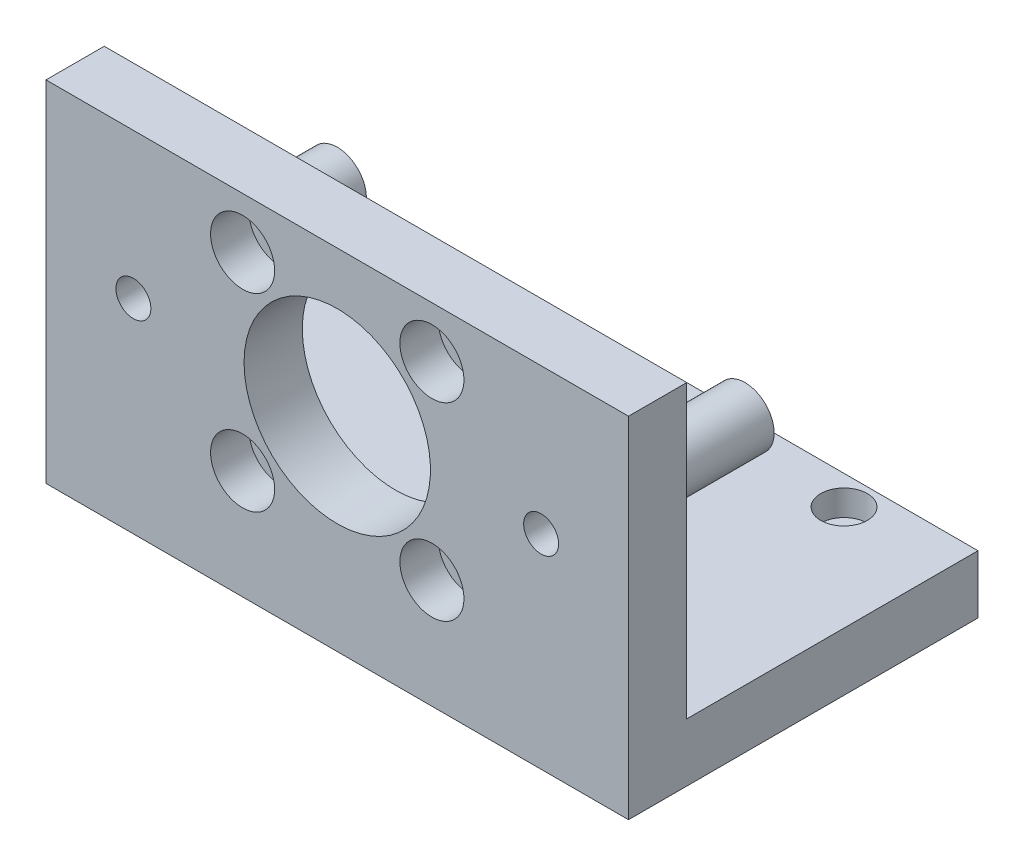
ISO-10303-21;
HEADER;
FILE_DESCRIPTION(('STEP AP214'),'2;1');
FILE_NAME('part.step','',(''),(''),'','','');
FILE_SCHEMA(('AUTOMOTIVE_DESIGN { 1 0 10303 214 1 1 1 1 }'));
ENDSEC;
DATA;
#1=APPLICATION_CONTEXT('core data for automotive mechanical design processes');
#2=APPLICATION_PROTOCOL_DEFINITION('international standard','automotive_design',2000,#1);
#3=PRODUCT_CONTEXT('',#1,'mechanical');
#4=PRODUCT('Part','Part','',(#3));
#5=PRODUCT_RELATED_PRODUCT_CATEGORY('part','',(#4));
#6=PRODUCT_DEFINITION_FORMATION('','',#4);
#7=PRODUCT_DEFINITION_CONTEXT('part definition',#1,'design');
#8=PRODUCT_DEFINITION('design','',#6,#7);
#9=PRODUCT_DEFINITION_SHAPE('','',#8);
#10=(LENGTH_UNIT() NAMED_UNIT(*) SI_UNIT(.MILLI.,.METRE.));
#11=(NAMED_UNIT(*) PLANE_ANGLE_UNIT() SI_UNIT($,.RADIAN.));
#12=(NAMED_UNIT(*) SI_UNIT($,.STERADIAN.) SOLID_ANGLE_UNIT());
#13=UNCERTAINTY_MEASURE_WITH_UNIT(LENGTH_MEASURE(1.E-05),#10,'distance_accuracy_value','');
#14=(GEOMETRIC_REPRESENTATION_CONTEXT(3) GLOBAL_UNCERTAINTY_ASSIGNED_CONTEXT((#13)) GLOBAL_UNIT_ASSIGNED_CONTEXT((#10,
#11,#12)) REPRESENTATION_CONTEXT('',''));
#15=CARTESIAN_POINT('',(0.,0.,0.));
#16=DIRECTION('',(0.,0.,1.));
#17=DIRECTION('',(1.,0.,0.));
#18=AXIS2_PLACEMENT_3D('',#15,#16,#17);
#19=CARTESIAN_POINT('',(0.,0.,25.));
#20=DIRECTION('',(0.,0.,-1.));
#21=DIRECTION('',(-1.,0.,0.));
#22=AXIS2_PLACEMENT_3D('',#19,#20,#21);
#23=PLANE('',#22);
#24=CARTESIAN_POINT('',(35.,35.,25.));
#25=DIRECTION('',(0.,0.,-1.));
#26=DIRECTION('',(-1.,0.,0.));
#27=AXIS2_PLACEMENT_3D('',#24,#25,#26);
#28=CIRCLE('',#27,5.);
#29=CARTESIAN_POINT('',(30.,35.,25.));
#30=VERTEX_POINT('',#29);
#31=EDGE_CURVE('E525',#30,#30,#28,.T.);
#32=ORIENTED_EDGE('',*,*,#31,.F.);
#33=EDGE_LOOP('',(#32));
#34=FACE_BOUND('',#33,.T.);
#35=CARTESIAN_POINT('',(-16.25,51.25,25.));
#36=DIRECTION('',(0.,0.,-1.));
#37=DIRECTION('',(-1.,0.,0.));
#38=AXIS2_PLACEMENT_3D('',#35,#36,#37);
#39=CIRCLE('',#38,3.3);
#40=CARTESIAN_POINT('',(-19.55,51.25,25.));
#41=VERTEX_POINT('',#40);
#42=EDGE_CURVE('E171',#41,#41,#39,.T.);
#43=ORIENTED_EDGE('',*,*,#42,.F.);
#44=EDGE_LOOP('',(#43));
#45=FACE_BOUND('',#44,.T.);
#46=CARTESIAN_POINT('',(-16.25,18.75,25.));
#47=DIRECTION('',(0.,0.,-1.));
#48=DIRECTION('',(-1.,0.,0.));
#49=AXIS2_PLACEMENT_3D('',#46,#47,#48);
#50=CIRCLE('',#49,3.3);
#51=CARTESIAN_POINT('',(-19.55,18.75,25.));
#52=VERTEX_POINT('',#51);
#53=EDGE_CURVE('E177',#52,#52,#50,.T.);
#54=ORIENTED_EDGE('',*,*,#53,.F.);
#55=EDGE_LOOP('',(#54));
#56=FACE_BOUND('',#55,.T.);
#57=CARTESIAN_POINT('',(16.25,18.75,25.));
#58=DIRECTION('',(0.,0.,-1.));
#59=DIRECTION('',(-1.,0.,0.));
#60=AXIS2_PLACEMENT_3D('',#57,#58,#59);
#61=CIRCLE('',#60,3.3);
#62=CARTESIAN_POINT('',(12.95,18.75,25.));
#63=VERTEX_POINT('',#62);
#64=EDGE_CURVE('E184',#63,#63,#61,.T.);
#65=ORIENTED_EDGE('',*,*,#64,.F.);
#66=EDGE_LOOP('',(#65));
#67=FACE_BOUND('',#66,.T.);
#68=CARTESIAN_POINT('',(16.25,51.25,25.));
#69=DIRECTION('',(0.,0.,-1.));
#70=DIRECTION('',(-1.,0.,0.));
#71=AXIS2_PLACEMENT_3D('',#68,#69,#70);
#72=CIRCLE('',#71,3.3);
#73=CARTESIAN_POINT('',(12.95,51.25,25.));
#74=VERTEX_POINT('',#73);
#75=EDGE_CURVE('E188',#74,#74,#72,.T.);
#76=ORIENTED_EDGE('',*,*,#75,.F.);
#77=EDGE_LOOP('',(#76));
#78=FACE_BOUND('',#77,.T.);
#79=CARTESIAN_POINT('',(0.,35.,25.));
#80=DIRECTION('',(0.,0.,-1.));
#81=DIRECTION('',(-1.,0.,0.));
#82=AXIS2_PLACEMENT_3D('',#79,#80,#81);
#83=CIRCLE('',#82,16.);
#84=CARTESIAN_POINT('',(-16.,35.,25.));
#85=VERTEX_POINT('',#84);
#86=EDGE_CURVE('E192',#85,#85,#83,.T.);
#87=ORIENTED_EDGE('',*,*,#86,.F.);
#88=EDGE_LOOP('',(#87));
#89=FACE_BOUND('',#88,.T.);
#90=DIRECTION('',(1.,0.,0.));
#91=VECTOR('',#90,1.);
#92=CARTESIAN_POINT('',(-50.,10.,25.));
#93=LINE('',#92,#91);
#94=CARTESIAN_POINT('',(-50.,10.,25.));
#95=VERTEX_POINT('',#94);
#96=CARTESIAN_POINT('',(50.,10.,25.));
#97=VERTEX_POINT('',#96);
#98=EDGE_CURVE('E81',#95,#97,#93,.T.);
#99=ORIENTED_EDGE('',*,*,#98,.F.);
#100=DIRECTION('',(0.,-1.,0.));
#101=VECTOR('',#100,1.);
#102=CARTESIAN_POINT('',(-50.,0.,25.));
#103=LINE('',#102,#101);
#104=CARTESIAN_POINT('',(-50.,60.,25.));
#105=VERTEX_POINT('',#104);
#106=EDGE_CURVE('E197',#105,#95,#103,.T.);
#107=ORIENTED_EDGE('',*,*,#106,.F.);
#108=DIRECTION('',(-1.,0.,0.));
#109=VECTOR('',#108,1.);
#110=CARTESIAN_POINT('',(-50.,60.,25.));
#111=LINE('',#110,#109);
#112=CARTESIAN_POINT('',(50.,60.,25.));
#113=VERTEX_POINT('',#112);
#114=EDGE_CURVE('E206',#113,#105,#111,.T.);
#115=ORIENTED_EDGE('',*,*,#114,.F.);
#116=DIRECTION('',(0.,1.,0.));
#117=VECTOR('',#116,1.);
#118=CARTESIAN_POINT('',(50.,0.,25.));
#119=LINE('',#118,#117);
#120=EDGE_CURVE('E64',#97,#113,#119,.T.);
#121=ORIENTED_EDGE('',*,*,#120,.F.);
#122=EDGE_LOOP('',(#99,#107,#115,#121));
#123=FACE_BOUND('',#122,.T.);
#124=CARTESIAN_POINT('',(-35.,35.,25.));
#125=DIRECTION('',(0.,0.,-1.));
#126=DIRECTION('',(-1.,0.,0.));
#127=AXIS2_PLACEMENT_3D('',#124,#125,#126);
#128=CIRCLE('',#127,5.);
#129=CARTESIAN_POINT('',(-40.,35.,25.));
#130=VERTEX_POINT('',#129);
#131=EDGE_CURVE('E512',#130,#130,#128,.T.);
#132=ORIENTED_EDGE('',*,*,#131,.F.);
#133=EDGE_LOOP('',(#132));
#134=FACE_BOUND('',#133,.T.);
#135=ADVANCED_FACE('F44',(#34,#45,#56,#67,#78,#89,#123,#134),#23,.T.);
#136=CARTESIAN_POINT('',(16.25,51.25,35.));
#137=DIRECTION('',(0.,0.,-1.));
#138=DIRECTION('',(-1.,0.,0.));
#139=AXIS2_PLACEMENT_3D('',#136,#137,#138);
#140=CYLINDRICAL_SURFACE('',#139,3.3);
#141=ORIENTED_EDGE('',*,*,#75,.T.);
#142=EDGE_LOOP('',(#141));
#143=FACE_BOUND('',#142,.T.);
#144=CARTESIAN_POINT('',(16.25,51.25,28.4));
#145=DIRECTION('',(0.,0.,1.));
#146=DIRECTION('',(1.,0.,0.));
#147=AXIS2_PLACEMENT_3D('',#144,#145,#146);
#148=CIRCLE('',#147,3.3);
#149=CARTESIAN_POINT('',(19.55,51.25,28.4));
#150=VERTEX_POINT('',#149);
#151=EDGE_CURVE('E48',#150,#150,#148,.F.);
#152=ORIENTED_EDGE('',*,*,#151,.F.);
#153=EDGE_LOOP('',(#152));
#154=FACE_BOUND('',#153,.T.);
#155=ADVANCED_FACE('F307',(#143,#154),#140,.F.);
#156=CARTESIAN_POINT('',(16.25,18.75,35.));
#157=DIRECTION('',(0.,0.,-1.));
#158=DIRECTION('',(-1.,0.,0.));
#159=AXIS2_PLACEMENT_3D('',#156,#157,#158);
#160=CYLINDRICAL_SURFACE('',#159,3.3);
#161=ORIENTED_EDGE('',*,*,#64,.T.);
#162=EDGE_LOOP('',(#161));
#163=FACE_BOUND('',#162,.T.);
#164=CARTESIAN_POINT('',(16.25,18.75,28.4));
#165=DIRECTION('',(0.,0.,1.));
#166=DIRECTION('',(1.,0.,0.));
#167=AXIS2_PLACEMENT_3D('',#164,#165,#166);
#168=CIRCLE('',#167,3.3);
#169=CARTESIAN_POINT('',(19.55,18.75,28.4));
#170=VERTEX_POINT('',#169);
#171=EDGE_CURVE('E163',#170,#170,#168,.F.);
#172=ORIENTED_EDGE('',*,*,#171,.F.);
#173=EDGE_LOOP('',(#172));
#174=FACE_BOUND('',#173,.T.);
#175=ADVANCED_FACE('F313',(#163,#174),#160,.F.);
#176=CARTESIAN_POINT('',(-16.25,18.75,35.));
#177=DIRECTION('',(0.,0.,-1.));
#178=DIRECTION('',(-1.,0.,0.));
#179=AXIS2_PLACEMENT_3D('',#176,#177,#178);
#180=CYLINDRICAL_SURFACE('',#179,3.3);
#181=ORIENTED_EDGE('',*,*,#53,.T.);
#182=EDGE_LOOP('',(#181));
#183=FACE_BOUND('',#182,.T.);
#184=CARTESIAN_POINT('',(-16.25,18.75,28.4));
#185=DIRECTION('',(0.,0.,1.));
#186=DIRECTION('',(1.,0.,0.));
#187=AXIS2_PLACEMENT_3D('',#184,#185,#186);
#188=CIRCLE('',#187,3.3);
#189=CARTESIAN_POINT('',(-12.95,18.75,28.4));
#190=VERTEX_POINT('',#189);
#191=EDGE_CURVE('E159',#190,#190,#188,.F.);
#192=ORIENTED_EDGE('',*,*,#191,.F.);
#193=EDGE_LOOP('',(#192));
#194=FACE_BOUND('',#193,.T.);
#195=ADVANCED_FACE('F369',(#183,#194),#180,.F.);
#196=CARTESIAN_POINT('',(-16.25,51.25,35.));
#197=DIRECTION('',(0.,0.,-1.));
#198=DIRECTION('',(-1.,0.,0.));
#199=AXIS2_PLACEMENT_3D('',#196,#197,#198);
#200=CYLINDRICAL_SURFACE('',#199,3.3);
#201=ORIENTED_EDGE('',*,*,#42,.T.);
#202=EDGE_LOOP('',(#201));
#203=FACE_BOUND('',#202,.T.);
#204=CARTESIAN_POINT('',(-16.25,51.25,28.4));
#205=DIRECTION('',(0.,0.,1.));
#206=DIRECTION('',(1.,0.,0.));
#207=AXIS2_PLACEMENT_3D('',#204,#205,#206);
#208=CIRCLE('',#207,3.3);
#209=CARTESIAN_POINT('',(-12.95,51.25,28.4));
#210=VERTEX_POINT('',#209);
#211=EDGE_CURVE('E155',#210,#210,#208,.F.);
#212=ORIENTED_EDGE('',*,*,#211,.F.);
#213=EDGE_LOOP('',(#212));
#214=FACE_BOUND('',#213,.T.);
#215=ADVANCED_FACE('F364',(#203,#214),#200,.F.);
#216=CARTESIAN_POINT('',(32.,0.,-20.));
#217=DIRECTION('',(0.,1.,0.));
#218=DIRECTION('',(0.,0.,1.));
#219=AXIS2_PLACEMENT_3D('',#216,#217,#218);
#220=CYLINDRICAL_SURFACE('',#219,2.25);
#221=CARTESIAN_POINT('',(32.,0.,-20.));
#222=DIRECTION('',(0.,1.,0.));
#223=DIRECTION('',(0.,0.,1.));
#224=AXIS2_PLACEMENT_3D('',#221,#222,#223);
#225=CIRCLE('',#224,2.25);
#226=CARTESIAN_POINT('',(32.,0.,-17.75));
#227=VERTEX_POINT('',#226);
#228=EDGE_CURVE('E120',#227,#227,#225,.T.);
#229=ORIENTED_EDGE('',*,*,#228,.F.);
#230=EDGE_LOOP('',(#229));
#231=FACE_BOUND('',#230,.T.);
#232=CARTESIAN_POINT('',(32.,5.6,-20.));
#233=DIRECTION('',(0.,1.,0.));
#234=DIRECTION('',(0.,0.,1.));
#235=AXIS2_PLACEMENT_3D('',#232,#233,#234);
#236=CIRCLE('',#235,2.25);
#237=CARTESIAN_POINT('',(32.,5.6,-17.75));
#238=VERTEX_POINT('',#237);
#239=EDGE_CURVE('E150',#238,#238,#236,.F.);
#240=ORIENTED_EDGE('',*,*,#239,.F.);
#241=EDGE_LOOP('',(#240));
#242=FACE_BOUND('',#241,.T.);
#243=ADVANCED_FACE('F354',(#231,#242),#220,.F.);
#244=CARTESIAN_POINT('',(32.,0.,20.));
#245=DIRECTION('',(0.,1.,0.));
#246=DIRECTION('',(0.,0.,1.));
#247=AXIS2_PLACEMENT_3D('',#244,#245,#246);
#248=CYLINDRICAL_SURFACE('',#247,2.25);
#249=CARTESIAN_POINT('',(32.,0.,20.));
#250=DIRECTION('',(0.,1.,0.));
#251=DIRECTION('',(0.,0.,1.));
#252=AXIS2_PLACEMENT_3D('',#249,#250,#251);
#253=CIRCLE('',#252,2.25);
#254=CARTESIAN_POINT('',(32.,0.,22.25));
#255=VERTEX_POINT('',#254);
#256=EDGE_CURVE('E127',#255,#255,#253,.T.);
#257=ORIENTED_EDGE('',*,*,#256,.F.);
#258=EDGE_LOOP('',(#257));
#259=FACE_BOUND('',#258,.T.);
#260=CARTESIAN_POINT('',(32.,5.6,20.));
#261=DIRECTION('',(0.,1.,0.));
#262=DIRECTION('',(0.,0.,1.));
#263=AXIS2_PLACEMENT_3D('',#260,#261,#262);
#264=CIRCLE('',#263,2.25);
#265=CARTESIAN_POINT('',(32.,5.6,22.25));
#266=VERTEX_POINT('',#265);
#267=EDGE_CURVE('E146',#266,#266,#264,.F.);
#268=ORIENTED_EDGE('',*,*,#267,.F.);
#269=EDGE_LOOP('',(#268));
#270=FACE_BOUND('',#269,.T.);
#271=ADVANCED_FACE('F350',(#259,#270),#248,.F.);
#272=CARTESIAN_POINT('',(-32.,0.,20.));
#273=DIRECTION('',(0.,1.,0.));
#274=DIRECTION('',(0.,0.,1.));
#275=AXIS2_PLACEMENT_3D('',#272,#273,#274);
#276=CYLINDRICAL_SURFACE('',#275,2.25);
#277=CARTESIAN_POINT('',(-32.,0.,20.));
#278=DIRECTION('',(0.,1.,0.));
#279=DIRECTION('',(0.,0.,1.));
#280=AXIS2_PLACEMENT_3D('',#277,#278,#279);
#281=CIRCLE('',#280,2.25);
#282=CARTESIAN_POINT('',(-32.,0.,22.25));
#283=VERTEX_POINT('',#282);
#284=EDGE_CURVE('E263',#283,#283,#281,.T.);
#285=ORIENTED_EDGE('',*,*,#284,.F.);
#286=EDGE_LOOP('',(#285));
#287=FACE_BOUND('',#286,.T.);
#288=CARTESIAN_POINT('',(-32.,5.6,20.));
#289=DIRECTION('',(0.,1.,0.));
#290=DIRECTION('',(0.,0.,1.));
#291=AXIS2_PLACEMENT_3D('',#288,#289,#290);
#292=CIRCLE('',#291,2.25);
#293=CARTESIAN_POINT('',(-32.,5.6,22.25));
#294=VERTEX_POINT('',#293);
#295=EDGE_CURVE('E141',#294,#294,#292,.F.);
#296=ORIENTED_EDGE('',*,*,#295,.F.);
#297=EDGE_LOOP('',(#296));
#298=FACE_BOUND('',#297,.T.);
#299=ADVANCED_FACE('F353',(#287,#298),#276,.F.);
#300=CARTESIAN_POINT('',(-32.,0.,-20.));
#301=DIRECTION('',(0.,1.,0.));
#302=DIRECTION('',(0.,0.,1.));
#303=AXIS2_PLACEMENT_3D('',#300,#301,#302);
#304=CYLINDRICAL_SURFACE('',#303,2.25);
#305=CARTESIAN_POINT('',(-32.,0.,-20.));
#306=DIRECTION('',(0.,1.,0.));
#307=DIRECTION('',(0.,0.,1.));
#308=AXIS2_PLACEMENT_3D('',#305,#306,#307);
#309=CIRCLE('',#308,2.25);
#310=CARTESIAN_POINT('',(-32.,0.,-17.75));
#311=VERTEX_POINT('',#310);
#312=EDGE_CURVE('E154',#311,#311,#309,.T.);
#313=ORIENTED_EDGE('',*,*,#312,.F.);
#314=EDGE_LOOP('',(#313));
#315=FACE_BOUND('',#314,.T.);
#316=CARTESIAN_POINT('',(-32.,5.6,-20.));
#317=DIRECTION('',(0.,1.,0.));
#318=DIRECTION('',(0.,0.,1.));
#319=AXIS2_PLACEMENT_3D('',#316,#317,#318);
#320=CIRCLE('',#319,2.25);
#321=CARTESIAN_POINT('',(-32.,5.6,-17.75));
#322=VERTEX_POINT('',#321);
#323=EDGE_CURVE('E137',#322,#322,#320,.F.);
#324=ORIENTED_EDGE('',*,*,#323,.F.);
#325=EDGE_LOOP('',(#324));
#326=FACE_BOUND('',#325,.T.);
#327=ADVANCED_FACE('F358',(#315,#326),#304,.F.);
#328=CARTESIAN_POINT('',(50.,10.,25.));
#329=DIRECTION('',(-1.,0.,0.));
#330=DIRECTION('',(0.,0.,1.));
#331=AXIS2_PLACEMENT_3D('',#328,#329,#330);
#332=PLANE('',#331);
#333=DIRECTION('',(0.,0.,-1.));
#334=VECTOR('',#333,1.);
#335=CARTESIAN_POINT('',(50.,0.,25.));
#336=LINE('',#335,#334);
#337=CARTESIAN_POINT('',(50.,0.,35.));
#338=VERTEX_POINT('',#337);
#339=CARTESIAN_POINT('',(50.,0.,-25.));
#340=VERTEX_POINT('',#339);
#341=EDGE_CURVE('E112',#338,#340,#336,.T.);
#342=ORIENTED_EDGE('',*,*,#341,.T.);
#343=DIRECTION('',(0.,-1.,0.));
#344=VECTOR('',#343,1.);
#345=CARTESIAN_POINT('',(50.,10.,-25.));
#346=LINE('',#345,#344);
#347=CARTESIAN_POINT('',(50.,10.,-25.));
#348=VERTEX_POINT('',#347);
#349=EDGE_CURVE('E11',#348,#340,#346,.T.);
#350=ORIENTED_EDGE('',*,*,#349,.F.);
#351=DIRECTION('',(0.,0.,-1.));
#352=VECTOR('',#351,1.);
#353=CARTESIAN_POINT('',(50.,10.,25.));
#354=LINE('',#353,#352);
#355=EDGE_CURVE('E103',#97,#348,#354,.T.);
#356=ORIENTED_EDGE('',*,*,#355,.F.);
#357=ORIENTED_EDGE('',*,*,#120,.T.);
#358=DIRECTION('',(0.,0.,-1.));
#359=VECTOR('',#358,1.);
#360=CARTESIAN_POINT('',(50.,60.,35.));
#361=LINE('',#360,#359);
#362=CARTESIAN_POINT('',(50.,60.,35.));
#363=VERTEX_POINT('',#362);
#364=EDGE_CURVE('E225',#363,#113,#361,.T.);
#365=ORIENTED_EDGE('',*,*,#364,.F.);
#366=DIRECTION('',(0.,1.,0.));
#367=VECTOR('',#366,1.);
#368=CARTESIAN_POINT('',(50.,0.,35.));
#369=LINE('',#368,#367);
#370=EDGE_CURVE('E116',#338,#363,#369,.T.);
#371=ORIENTED_EDGE('',*,*,#370,.F.);
#372=EDGE_LOOP('',(#342,#350,#356,#357,#365,#371));
#373=FACE_BOUND('',#372,.T.);
#374=ADVANCED_FACE('F46',(#373),#332,.F.);
#375=CARTESIAN_POINT('',(-50.,10.,-25.));
#376=DIRECTION('',(0.,0.,1.));
#377=DIRECTION('',(1.,0.,0.));
#378=AXIS2_PLACEMENT_3D('',#375,#376,#377);
#379=PLANE('',#378);
#380=DIRECTION('',(-1.,0.,0.));
#381=VECTOR('',#380,1.);
#382=CARTESIAN_POINT('',(-50.,0.,-25.));
#383=LINE('',#382,#381);
#384=CARTESIAN_POINT('',(-50.,0.,-25.));
#385=VERTEX_POINT('',#384);
#386=EDGE_CURVE('E77',#340,#385,#383,.T.);
#387=ORIENTED_EDGE('',*,*,#386,.T.);
#388=DIRECTION('',(0.,-1.,0.));
#389=VECTOR('',#388,1.);
#390=CARTESIAN_POINT('',(-50.,10.,-25.));
#391=LINE('',#390,#389);
#392=CARTESIAN_POINT('',(-50.,10.,-25.));
#393=VERTEX_POINT('',#392);
#394=EDGE_CURVE('E55',#393,#385,#391,.T.);
#395=ORIENTED_EDGE('',*,*,#394,.F.);
#396=DIRECTION('',(-1.,0.,0.));
#397=VECTOR('',#396,1.);
#398=CARTESIAN_POINT('',(-50.,10.,-25.));
#399=LINE('',#398,#397);
#400=EDGE_CURVE('E92',#348,#393,#399,.T.);
#401=ORIENTED_EDGE('',*,*,#400,.F.);
#402=ORIENTED_EDGE('',*,*,#349,.T.);
#403=EDGE_LOOP('',(#387,#395,#401,#402));
#404=FACE_BOUND('',#403,.T.);
#405=ADVANCED_FACE('F94',(#404),#379,.F.);
#406=CARTESIAN_POINT('',(-50.,10.,25.));
#407=DIRECTION('',(1.,0.,0.));
#408=DIRECTION('',(0.,0.,-1.));
#409=AXIS2_PLACEMENT_3D('',#406,#407,#408);
#410=PLANE('',#409);
#411=DIRECTION('',(0.,0.,1.));
#412=VECTOR('',#411,1.);
#413=CARTESIAN_POINT('',(-50.,0.,25.));
#414=LINE('',#413,#412);
#415=CARTESIAN_POINT('',(-50.,0.,35.));
#416=VERTEX_POINT('',#415);
#417=EDGE_CURVE('E109',#385,#416,#414,.T.);
#418=ORIENTED_EDGE('',*,*,#417,.T.);
#419=DIRECTION('',(0.,-1.,0.));
#420=VECTOR('',#419,1.);
#421=CARTESIAN_POINT('',(-50.,0.,35.));
#422=LINE('',#421,#420);
#423=CARTESIAN_POINT('',(-50.,60.,35.));
#424=VERTEX_POINT('',#423);
#425=EDGE_CURVE('E201',#424,#416,#422,.T.);
#426=ORIENTED_EDGE('',*,*,#425,.F.);
#427=DIRECTION('',(0.,0.,-1.));
#428=VECTOR('',#427,1.);
#429=CARTESIAN_POINT('',(-50.,60.,35.));
#430=LINE('',#429,#428);
#431=EDGE_CURVE('E214',#424,#105,#430,.T.);
#432=ORIENTED_EDGE('',*,*,#431,.T.);
#433=ORIENTED_EDGE('',*,*,#106,.T.);
#434=DIRECTION('',(0.,0.,1.));
#435=VECTOR('',#434,1.);
#436=CARTESIAN_POINT('',(-50.,10.,25.));
#437=LINE('',#436,#435);
#438=EDGE_CURVE('E102',#393,#95,#437,.T.);
#439=ORIENTED_EDGE('',*,*,#438,.F.);
#440=ORIENTED_EDGE('',*,*,#394,.T.);
#441=EDGE_LOOP('',(#418,#426,#432,#433,#439,#440));
#442=FACE_BOUND('',#441,.T.);
#443=ADVANCED_FACE('F276',(#442),#410,.F.);
#444=CARTESIAN_POINT('',(0.,10.,0.));
#445=DIRECTION('',(0.,-1.,0.));
#446=DIRECTION('',(0.,0.,-1.));
#447=AXIS2_PLACEMENT_3D('',#444,#445,#446);
#448=PLANE('',#447);
#449=CARTESIAN_POINT('',(32.,10.,20.));
#450=DIRECTION('',(0.,1.,0.));
#451=DIRECTION('',(0.,0.,1.));
#452=AXIS2_PLACEMENT_3D('',#449,#450,#451);
#453=CIRCLE('',#452,4.00000000000001);
#454=CARTESIAN_POINT('',(32.,10.,24.));
#455=VERTEX_POINT('',#454);
#456=EDGE_CURVE('E243',#455,#455,#453,.T.);
#457=ORIENTED_EDGE('',*,*,#456,.F.);
#458=EDGE_LOOP('',(#457));
#459=FACE_BOUND('',#458,.T.);
#460=CARTESIAN_POINT('',(-32.,10.,-20.));
#461=DIRECTION('',(0.,1.,0.));
#462=DIRECTION('',(0.,0.,1.));
#463=AXIS2_PLACEMENT_3D('',#460,#461,#462);
#464=CIRCLE('',#463,4.);
#465=CARTESIAN_POINT('',(-32.,10.,-16.));
#466=VERTEX_POINT('',#465);
#467=EDGE_CURVE('E234',#466,#466,#464,.T.);
#468=ORIENTED_EDGE('',*,*,#467,.F.);
#469=EDGE_LOOP('',(#468));
#470=FACE_BOUND('',#469,.T.);
#471=CARTESIAN_POINT('',(-32.,10.,20.));
#472=DIRECTION('',(0.,1.,0.));
#473=DIRECTION('',(0.,0.,1.));
#474=AXIS2_PLACEMENT_3D('',#471,#472,#473);
#475=CIRCLE('',#474,4.);
#476=CARTESIAN_POINT('',(-32.,10.,24.));
#477=VERTEX_POINT('',#476);
#478=EDGE_CURVE('E229',#477,#477,#475,.T.);
#479=ORIENTED_EDGE('',*,*,#478,.F.);
#480=EDGE_LOOP('',(#479));
#481=FACE_BOUND('',#480,.T.);
#482=CARTESIAN_POINT('',(32.,10.,-20.));
#483=DIRECTION('',(0.,1.,0.));
#484=DIRECTION('',(0.,0.,1.));
#485=AXIS2_PLACEMENT_3D('',#482,#483,#484);
#486=CIRCLE('',#485,4.00000000000001);
#487=CARTESIAN_POINT('',(32.,10.,-16.));
#488=VERTEX_POINT('',#487);
#489=EDGE_CURVE('E242',#488,#488,#486,.T.);
#490=ORIENTED_EDGE('',*,*,#489,.F.);
#491=EDGE_LOOP('',(#490));
#492=FACE_BOUND('',#491,.T.);
#493=ORIENTED_EDGE('',*,*,#355,.T.);
#494=ORIENTED_EDGE('',*,*,#400,.T.);
#495=ORIENTED_EDGE('',*,*,#438,.T.);
#496=ORIENTED_EDGE('',*,*,#98,.T.);
#497=EDGE_LOOP('',(#493,#494,#495,#496));
#498=FACE_BOUND('',#497,.T.);
#499=ADVANCED_FACE('F106',(#459,#470,#481,#492,#498),#448,.F.);
#500=CARTESIAN_POINT('',(0.,0.,0.));
#501=DIRECTION('',(0.,-1.,0.));
#502=DIRECTION('',(0.,0.,-1.));
#503=AXIS2_PLACEMENT_3D('',#500,#501,#502);
#504=PLANE('',#503);
#505=ORIENTED_EDGE('',*,*,#312,.T.);
#506=EDGE_LOOP('',(#505));
#507=FACE_BOUND('',#506,.T.);
#508=ORIENTED_EDGE('',*,*,#284,.T.);
#509=EDGE_LOOP('',(#508));
#510=FACE_BOUND('',#509,.T.);
#511=ORIENTED_EDGE('',*,*,#256,.T.);
#512=EDGE_LOOP('',(#511));
#513=FACE_BOUND('',#512,.T.);
#514=ORIENTED_EDGE('',*,*,#228,.T.);
#515=EDGE_LOOP('',(#514));
#516=FACE_BOUND('',#515,.T.);
#517=ORIENTED_EDGE('',*,*,#341,.F.);
#518=DIRECTION('',(1.,0.,0.));
#519=VECTOR('',#518,1.);
#520=CARTESIAN_POINT('',(-50.,0.,35.));
#521=LINE('',#520,#519);
#522=EDGE_CURVE('E205',#416,#338,#521,.T.);
#523=ORIENTED_EDGE('',*,*,#522,.F.);
#524=ORIENTED_EDGE('',*,*,#417,.F.);
#525=ORIENTED_EDGE('',*,*,#386,.F.);
#526=EDGE_LOOP('',(#517,#523,#524,#525));
#527=FACE_BOUND('',#526,.T.);
#528=ADVANCED_FACE('F290',(#507,#510,#513,#516,#527),#504,.T.);
#529=CARTESIAN_POINT('',(-32.,5.6,-20.));
#530=DIRECTION('',(0.,1.,0.));
#531=DIRECTION('',(0.,0.,1.));
#532=AXIS2_PLACEMENT_3D('',#529,#530,#531);
#533=PLANE('',#532);
#534=CARTESIAN_POINT('',(-32.,5.6,-20.));
#535=DIRECTION('',(0.,1.,0.));
#536=DIRECTION('',(0.,0.,1.));
#537=AXIS2_PLACEMENT_3D('',#534,#535,#536);
#538=CIRCLE('',#537,4.);
#539=CARTESIAN_POINT('',(-32.,5.6,-16.));
#540=VERTEX_POINT('',#539);
#541=EDGE_CURVE('E247',#540,#540,#538,.T.);
#542=ORIENTED_EDGE('',*,*,#541,.T.);
#543=EDGE_LOOP('',(#542));
#544=FACE_BOUND('',#543,.T.);
#545=ORIENTED_EDGE('',*,*,#323,.T.);
#546=EDGE_LOOP('',(#545));
#547=FACE_BOUND('',#546,.T.);
#548=ADVANCED_FACE('F292',(#544,#547),#533,.T.);
#549=CARTESIAN_POINT('',(-32.,5.6,-20.));
#550=DIRECTION('',(0.,1.,0.));
#551=DIRECTION('',(0.,0.,1.));
#552=AXIS2_PLACEMENT_3D('',#549,#550,#551);
#553=CYLINDRICAL_SURFACE('',#552,4.);
#554=ORIENTED_EDGE('',*,*,#541,.F.);
#555=EDGE_LOOP('',(#554));
#556=FACE_BOUND('',#555,.T.);
#557=ORIENTED_EDGE('',*,*,#467,.T.);
#558=EDGE_LOOP('',(#557));
#559=FACE_BOUND('',#558,.T.);
#560=ADVANCED_FACE('F299',(#556,#559),#553,.F.);
#561=CARTESIAN_POINT('',(-32.,5.6,20.));
#562=DIRECTION('',(0.,1.,0.));
#563=DIRECTION('',(0.,0.,1.));
#564=AXIS2_PLACEMENT_3D('',#561,#562,#563);
#565=PLANE('',#564);
#566=CARTESIAN_POINT('',(-32.,5.6,20.));
#567=DIRECTION('',(0.,1.,0.));
#568=DIRECTION('',(0.,0.,1.));
#569=AXIS2_PLACEMENT_3D('',#566,#567,#568);
#570=CIRCLE('',#569,4.);
#571=CARTESIAN_POINT('',(-32.,5.6,24.));
#572=VERTEX_POINT('',#571);
#573=EDGE_CURVE('E230',#572,#572,#570,.T.);
#574=ORIENTED_EDGE('',*,*,#573,.T.);
#575=EDGE_LOOP('',(#574));
#576=FACE_BOUND('',#575,.T.);
#577=ORIENTED_EDGE('',*,*,#295,.T.);
#578=EDGE_LOOP('',(#577));
#579=FACE_BOUND('',#578,.T.);
#580=ADVANCED_FACE('F324',(#576,#579),#565,.T.);
#581=CARTESIAN_POINT('',(-32.,5.6,20.));
#582=DIRECTION('',(0.,1.,0.));
#583=DIRECTION('',(0.,0.,1.));
#584=AXIS2_PLACEMENT_3D('',#581,#582,#583);
#585=CYLINDRICAL_SURFACE('',#584,4.);
#586=ORIENTED_EDGE('',*,*,#573,.F.);
#587=EDGE_LOOP('',(#586));
#588=FACE_BOUND('',#587,.T.);
#589=ORIENTED_EDGE('',*,*,#478,.T.);
#590=EDGE_LOOP('',(#589));
#591=FACE_BOUND('',#590,.T.);
#592=ADVANCED_FACE('F327',(#588,#591),#585,.F.);
#593=CARTESIAN_POINT('',(32.,5.6,20.));
#594=DIRECTION('',(0.,1.,0.));
#595=DIRECTION('',(0.,0.,1.));
#596=AXIS2_PLACEMENT_3D('',#593,#594,#595);
#597=PLANE('',#596);
#598=CARTESIAN_POINT('',(32.,5.6,20.));
#599=DIRECTION('',(0.,1.,0.));
#600=DIRECTION('',(0.,0.,1.));
#601=AXIS2_PLACEMENT_3D('',#598,#599,#600);
#602=CIRCLE('',#601,4.00000000000001);
#603=CARTESIAN_POINT('',(32.,5.6,24.));
#604=VERTEX_POINT('',#603);
#605=EDGE_CURVE('E238',#604,#604,#602,.T.);
#606=ORIENTED_EDGE('',*,*,#605,.T.);
#607=EDGE_LOOP('',(#606));
#608=FACE_BOUND('',#607,.T.);
#609=ORIENTED_EDGE('',*,*,#267,.T.);
#610=EDGE_LOOP('',(#609));
#611=FACE_BOUND('',#610,.T.);
#612=ADVANCED_FACE('F331',(#608,#611),#597,.T.);
#613=CARTESIAN_POINT('',(32.,5.6,20.));
#614=DIRECTION('',(0.,1.,0.));
#615=DIRECTION('',(0.,0.,1.));
#616=AXIS2_PLACEMENT_3D('',#613,#614,#615);
#617=CYLINDRICAL_SURFACE('',#616,4.00000000000001);
#618=ORIENTED_EDGE('',*,*,#605,.F.);
#619=EDGE_LOOP('',(#618));
#620=FACE_BOUND('',#619,.T.);
#621=ORIENTED_EDGE('',*,*,#456,.T.);
#622=EDGE_LOOP('',(#621));
#623=FACE_BOUND('',#622,.T.);
#624=ADVANCED_FACE('F335',(#620,#623),#617,.F.);
#625=CARTESIAN_POINT('',(32.,5.6,-20.));
#626=DIRECTION('',(0.,1.,0.));
#627=DIRECTION('',(0.,0.,1.));
#628=AXIS2_PLACEMENT_3D('',#625,#626,#627);
#629=PLANE('',#628);
#630=CARTESIAN_POINT('',(32.,5.6,-20.));
#631=DIRECTION('',(0.,1.,0.));
#632=DIRECTION('',(0.,0.,1.));
#633=AXIS2_PLACEMENT_3D('',#630,#631,#632);
#634=CIRCLE('',#633,4.00000000000001);
#635=CARTESIAN_POINT('',(32.,5.6,-16.));
#636=VERTEX_POINT('',#635);
#637=EDGE_CURVE('E142',#636,#636,#634,.T.);
#638=ORIENTED_EDGE('',*,*,#637,.T.);
#639=EDGE_LOOP('',(#638));
#640=FACE_BOUND('',#639,.T.);
#641=ORIENTED_EDGE('',*,*,#239,.T.);
#642=EDGE_LOOP('',(#641));
#643=FACE_BOUND('',#642,.T.);
#644=ADVANCED_FACE('F338',(#640,#643),#629,.T.);
#645=CARTESIAN_POINT('',(32.,5.6,-20.));
#646=DIRECTION('',(0.,1.,0.));
#647=DIRECTION('',(0.,0.,1.));
#648=AXIS2_PLACEMENT_3D('',#645,#646,#647);
#649=CYLINDRICAL_SURFACE('',#648,4.00000000000001);
#650=ORIENTED_EDGE('',*,*,#637,.F.);
#651=EDGE_LOOP('',(#650));
#652=FACE_BOUND('',#651,.T.);
#653=ORIENTED_EDGE('',*,*,#489,.T.);
#654=EDGE_LOOP('',(#653));
#655=FACE_BOUND('',#654,.T.);
#656=ADVANCED_FACE('F323',(#652,#655),#649,.F.);
#657=CARTESIAN_POINT('',(-50.,60.,35.));
#658=DIRECTION('',(0.,-1.,0.));
#659=DIRECTION('',(0.,0.,-1.));
#660=AXIS2_PLACEMENT_3D('',#657,#658,#659);
#661=PLANE('',#660);
#662=ORIENTED_EDGE('',*,*,#114,.T.);
#663=ORIENTED_EDGE('',*,*,#431,.F.);
#664=DIRECTION('',(-1.,0.,0.));
#665=VECTOR('',#664,1.);
#666=CARTESIAN_POINT('',(-50.,60.,35.));
#667=LINE('',#666,#665);
#668=EDGE_CURVE('E211',#363,#424,#667,.T.);
#669=ORIENTED_EDGE('',*,*,#668,.F.);
#670=ORIENTED_EDGE('',*,*,#364,.T.);
#671=EDGE_LOOP('',(#662,#663,#669,#670));
#672=FACE_BOUND('',#671,.T.);
#673=ADVANCED_FACE('F289',(#672),#661,.F.);
#674=CARTESIAN_POINT('',(0.,0.,35.));
#675=DIRECTION('',(0.,0.,-1.));
#676=DIRECTION('',(-1.,0.,0.));
#677=AXIS2_PLACEMENT_3D('',#674,#675,#676);
#678=PLANE('',#677);
#679=CARTESIAN_POINT('',(35.,35.,35.));
#680=DIRECTION('',(0.,0.,-1.));
#681=DIRECTION('',(-1.,0.,0.));
#682=AXIS2_PLACEMENT_3D('',#679,#680,#681);
#683=CIRCLE('',#682,3.);
#684=CARTESIAN_POINT('',(32.,35.,35.));
#685=VERTEX_POINT('',#684);
#686=EDGE_CURVE('E405',#685,#685,#683,.T.);
#687=ORIENTED_EDGE('',*,*,#686,.T.);
#688=EDGE_LOOP('',(#687));
#689=FACE_BOUND('',#688,.T.);
#690=CARTESIAN_POINT('',(-35.,35.,35.));
#691=DIRECTION('',(0.,0.,-1.));
#692=DIRECTION('',(-1.,0.,0.));
#693=AXIS2_PLACEMENT_3D('',#690,#691,#692);
#694=CIRCLE('',#693,3.);
#695=CARTESIAN_POINT('',(-38.,35.,35.));
#696=VERTEX_POINT('',#695);
#697=EDGE_CURVE('E409',#696,#696,#694,.T.);
#698=ORIENTED_EDGE('',*,*,#697,.T.);
#699=EDGE_LOOP('',(#698));
#700=FACE_BOUND('',#699,.T.);
#701=CARTESIAN_POINT('',(-16.25,18.75,35.));
#702=DIRECTION('',(0.,0.,1.));
#703=DIRECTION('',(1.,0.,0.));
#704=AXIS2_PLACEMENT_3D('',#701,#702,#703);
#705=CIRCLE('',#704,5.5);
#706=CARTESIAN_POINT('',(-10.75,18.75,35.));
#707=VERTEX_POINT('',#706);
#708=EDGE_CURVE('E413',#707,#707,#705,.T.);
#709=ORIENTED_EDGE('',*,*,#708,.F.);
#710=EDGE_LOOP('',(#709));
#711=FACE_BOUND('',#710,.T.);
#712=CARTESIAN_POINT('',(16.25,18.75,35.));
#713=DIRECTION('',(0.,0.,1.));
#714=DIRECTION('',(1.,0.,0.));
#715=AXIS2_PLACEMENT_3D('',#712,#713,#714);
#716=CIRCLE('',#715,5.5);
#717=CARTESIAN_POINT('',(21.75,18.75,35.));
#718=VERTEX_POINT('',#717);
#719=EDGE_CURVE('E417',#718,#718,#716,.T.);
#720=ORIENTED_EDGE('',*,*,#719,.F.);
#721=EDGE_LOOP('',(#720));
#722=FACE_BOUND('',#721,.T.);
#723=CARTESIAN_POINT('',(16.25,51.25,35.));
#724=DIRECTION('',(0.,0.,1.));
#725=DIRECTION('',(1.,0.,0.));
#726=AXIS2_PLACEMENT_3D('',#723,#724,#725);
#727=CIRCLE('',#726,5.5);
#728=CARTESIAN_POINT('',(21.75,51.25,35.));
#729=VERTEX_POINT('',#728);
#730=EDGE_CURVE('E421',#729,#729,#727,.T.);
#731=ORIENTED_EDGE('',*,*,#730,.F.);
#732=EDGE_LOOP('',(#731));
#733=FACE_BOUND('',#732,.T.);
#734=CARTESIAN_POINT('',(-16.25,51.25,35.));
#735=DIRECTION('',(0.,0.,1.));
#736=DIRECTION('',(1.,0.,0.));
#737=AXIS2_PLACEMENT_3D('',#734,#735,#736);
#738=CIRCLE('',#737,5.5);
#739=CARTESIAN_POINT('',(-10.75,51.25,35.));
#740=VERTEX_POINT('',#739);
#741=EDGE_CURVE('E424',#740,#740,#738,.T.);
#742=ORIENTED_EDGE('',*,*,#741,.F.);
#743=EDGE_LOOP('',(#742));
#744=FACE_BOUND('',#743,.T.);
#745=CARTESIAN_POINT('',(0.,35.,35.));
#746=DIRECTION('',(0.,0.,-1.));
#747=DIRECTION('',(-1.,0.,0.));
#748=AXIS2_PLACEMENT_3D('',#745,#746,#747);
#749=CIRCLE('',#748,16.);
#750=CARTESIAN_POINT('',(-16.,35.,35.));
#751=VERTEX_POINT('',#750);
#752=EDGE_CURVE('E193',#751,#751,#749,.T.);
#753=ORIENTED_EDGE('',*,*,#752,.T.);
#754=EDGE_LOOP('',(#753));
#755=FACE_BOUND('',#754,.T.);
#756=ORIENTED_EDGE('',*,*,#425,.T.);
#757=ORIENTED_EDGE('',*,*,#522,.T.);
#758=ORIENTED_EDGE('',*,*,#370,.T.);
#759=ORIENTED_EDGE('',*,*,#668,.T.);
#760=EDGE_LOOP('',(#756,#757,#758,#759));
#761=FACE_BOUND('',#760,.T.);
#762=ADVANCED_FACE('F287',(#689,#700,#711,#722,#733,#744,#755,#761),#678,.F.);
#763=CARTESIAN_POINT('',(0.,35.,35.));
#764=DIRECTION('',(0.,0.,-1.));
#765=DIRECTION('',(-1.,0.,0.));
#766=AXIS2_PLACEMENT_3D('',#763,#764,#765);
#767=CYLINDRICAL_SURFACE('',#766,16.);
#768=ORIENTED_EDGE('',*,*,#752,.F.);
#769=EDGE_LOOP('',(#768));
#770=FACE_BOUND('',#769,.T.);
#771=ORIENTED_EDGE('',*,*,#86,.T.);
#772=EDGE_LOOP('',(#771));
#773=FACE_BOUND('',#772,.T.);
#774=ADVANCED_FACE('F383',(#770,#773),#767,.F.);
#775=CARTESIAN_POINT('',(-16.25,51.25,28.4));
#776=DIRECTION('',(0.,0.,1.));
#777=DIRECTION('',(1.,0.,0.));
#778=AXIS2_PLACEMENT_3D('',#775,#776,#777);
#779=PLANE('',#778);
#780=CARTESIAN_POINT('',(-16.25,51.25,28.4));
#781=DIRECTION('',(0.,0.,1.));
#782=DIRECTION('',(1.,0.,0.));
#783=AXIS2_PLACEMENT_3D('',#780,#781,#782);
#784=CIRCLE('',#783,5.5);
#785=CARTESIAN_POINT('',(-10.75,51.25,28.4));
#786=VERTEX_POINT('',#785);
#787=EDGE_CURVE('E160',#786,#786,#784,.T.);
#788=ORIENTED_EDGE('',*,*,#787,.T.);
#789=EDGE_LOOP('',(#788));
#790=FACE_BOUND('',#789,.T.);
#791=ORIENTED_EDGE('',*,*,#211,.T.);
#792=EDGE_LOOP('',(#791));
#793=FACE_BOUND('',#792,.T.);
#794=ADVANCED_FACE('F385',(#790,#793),#779,.T.);
#795=CARTESIAN_POINT('',(-16.25,51.25,28.4));
#796=DIRECTION('',(0.,0.,1.));
#797=DIRECTION('',(1.,0.,0.));
#798=AXIS2_PLACEMENT_3D('',#795,#796,#797);
#799=CYLINDRICAL_SURFACE('',#798,5.5);
#800=ORIENTED_EDGE('',*,*,#787,.F.);
#801=EDGE_LOOP('',(#800));
#802=FACE_BOUND('',#801,.T.);
#803=ORIENTED_EDGE('',*,*,#741,.T.);
#804=EDGE_LOOP('',(#803));
#805=FACE_BOUND('',#804,.T.);
#806=ADVANCED_FACE('F391',(#802,#805),#799,.F.);
#807=CARTESIAN_POINT('',(-16.25,18.75,28.4));
#808=DIRECTION('',(0.,0.,1.));
#809=DIRECTION('',(1.,0.,0.));
#810=AXIS2_PLACEMENT_3D('',#807,#808,#809);
#811=PLANE('',#810);
#812=CARTESIAN_POINT('',(-16.25,18.75,28.4));
#813=DIRECTION('',(0.,0.,1.));
#814=DIRECTION('',(1.,0.,0.));
#815=AXIS2_PLACEMENT_3D('',#812,#813,#814);
#816=CIRCLE('',#815,5.5);
#817=CARTESIAN_POINT('',(-10.75,18.75,28.4));
#818=VERTEX_POINT('',#817);
#819=EDGE_CURVE('E545',#818,#818,#816,.T.);
#820=ORIENTED_EDGE('',*,*,#819,.T.);
#821=EDGE_LOOP('',(#820));
#822=FACE_BOUND('',#821,.T.);
#823=ORIENTED_EDGE('',*,*,#191,.T.);
#824=EDGE_LOOP('',(#823));
#825=FACE_BOUND('',#824,.T.);
#826=ADVANCED_FACE('F452',(#822,#825),#811,.T.);
#827=CARTESIAN_POINT('',(-16.25,18.75,28.4));
#828=DIRECTION('',(0.,0.,1.));
#829=DIRECTION('',(1.,0.,0.));
#830=AXIS2_PLACEMENT_3D('',#827,#828,#829);
#831=CYLINDRICAL_SURFACE('',#830,5.5);
#832=ORIENTED_EDGE('',*,*,#819,.F.);
#833=EDGE_LOOP('',(#832));
#834=FACE_BOUND('',#833,.T.);
#835=ORIENTED_EDGE('',*,*,#708,.T.);
#836=EDGE_LOOP('',(#835));
#837=FACE_BOUND('',#836,.T.);
#838=ADVANCED_FACE('F455',(#834,#837),#831,.F.);
#839=CARTESIAN_POINT('',(16.25,18.75,28.4));
#840=DIRECTION('',(0.,0.,1.));
#841=DIRECTION('',(1.,0.,0.));
#842=AXIS2_PLACEMENT_3D('',#839,#840,#841);
#843=PLANE('',#842);
#844=CARTESIAN_POINT('',(16.25,18.75,28.4));
#845=DIRECTION('',(0.,0.,1.));
#846=DIRECTION('',(1.,0.,0.));
#847=AXIS2_PLACEMENT_3D('',#844,#845,#846);
#848=CIRCLE('',#847,5.5);
#849=CARTESIAN_POINT('',(21.75,18.75,28.4));
#850=VERTEX_POINT('',#849);
#851=EDGE_CURVE('E539',#850,#850,#848,.T.);
#852=ORIENTED_EDGE('',*,*,#851,.T.);
#853=EDGE_LOOP('',(#852));
#854=FACE_BOUND('',#853,.T.);
#855=ORIENTED_EDGE('',*,*,#171,.T.);
#856=EDGE_LOOP('',(#855));
#857=FACE_BOUND('',#856,.T.);
#858=ADVANCED_FACE('F458',(#854,#857),#843,.T.);
#859=CARTESIAN_POINT('',(16.25,18.75,28.4));
#860=DIRECTION('',(0.,0.,1.));
#861=DIRECTION('',(1.,0.,0.));
#862=AXIS2_PLACEMENT_3D('',#859,#860,#861);
#863=CYLINDRICAL_SURFACE('',#862,5.5);
#864=ORIENTED_EDGE('',*,*,#851,.F.);
#865=EDGE_LOOP('',(#864));
#866=FACE_BOUND('',#865,.T.);
#867=ORIENTED_EDGE('',*,*,#719,.T.);
#868=EDGE_LOOP('',(#867));
#869=FACE_BOUND('',#868,.T.);
#870=ADVANCED_FACE('F463',(#866,#869),#863,.F.);
#871=CARTESIAN_POINT('',(16.25,51.25,28.4));
#872=DIRECTION('',(0.,0.,1.));
#873=DIRECTION('',(1.,0.,0.));
#874=AXIS2_PLACEMENT_3D('',#871,#872,#873);
#875=PLANE('',#874);
#876=CARTESIAN_POINT('',(16.25,51.25,28.4));
#877=DIRECTION('',(0.,0.,1.));
#878=DIRECTION('',(1.,0.,0.));
#879=AXIS2_PLACEMENT_3D('',#876,#877,#878);
#880=CIRCLE('',#879,5.5);
#881=CARTESIAN_POINT('',(21.75,51.25,28.4));
#882=VERTEX_POINT('',#881);
#883=EDGE_CURVE('E427',#882,#882,#880,.T.);
#884=ORIENTED_EDGE('',*,*,#883,.T.);
#885=EDGE_LOOP('',(#884));
#886=FACE_BOUND('',#885,.T.);
#887=ORIENTED_EDGE('',*,*,#151,.T.);
#888=EDGE_LOOP('',(#887));
#889=FACE_BOUND('',#888,.T.);
#890=ADVANCED_FACE('F466',(#886,#889),#875,.T.);
#891=CARTESIAN_POINT('',(16.25,51.25,28.4));
#892=DIRECTION('',(0.,0.,1.));
#893=DIRECTION('',(1.,0.,0.));
#894=AXIS2_PLACEMENT_3D('',#891,#892,#893);
#895=CYLINDRICAL_SURFACE('',#894,5.5);
#896=ORIENTED_EDGE('',*,*,#883,.F.);
#897=EDGE_LOOP('',(#896));
#898=FACE_BOUND('',#897,.T.);
#899=ORIENTED_EDGE('',*,*,#730,.T.);
#900=EDGE_LOOP('',(#899));
#901=FACE_BOUND('',#900,.T.);
#902=ADVANCED_FACE('F471',(#898,#901),#895,.F.);
#903=CARTESIAN_POINT('',(-35.,35.,35.));
#904=DIRECTION('',(0.,0.,-1.));
#905=DIRECTION('',(-1.,0.,0.));
#906=AXIS2_PLACEMENT_3D('',#903,#904,#905);
#907=CYLINDRICAL_SURFACE('',#906,3.);
#908=ORIENTED_EDGE('',*,*,#697,.F.);
#909=EDGE_LOOP('',(#908));
#910=FACE_BOUND('',#909,.T.);
#911=CARTESIAN_POINT('',(-35.,35.,0.));
#912=DIRECTION('',(0.,0.,-1.));
#913=DIRECTION('',(-1.,0.,0.));
#914=AXIS2_PLACEMENT_3D('',#911,#912,#913);
#915=CIRCLE('',#914,3.);
#916=CARTESIAN_POINT('',(-38.,35.,0.));
#917=VERTEX_POINT('',#916);
#918=EDGE_CURVE('E509',#917,#917,#915,.T.);
#919=ORIENTED_EDGE('',*,*,#918,.T.);
#920=EDGE_LOOP('',(#919));
#921=FACE_BOUND('',#920,.T.);
#922=ADVANCED_FACE('F474',(#910,#921),#907,.F.);
#923=CARTESIAN_POINT('',(35.,35.,35.));
#924=DIRECTION('',(0.,0.,-1.));
#925=DIRECTION('',(-1.,0.,0.));
#926=AXIS2_PLACEMENT_3D('',#923,#924,#925);
#927=CYLINDRICAL_SURFACE('',#926,3.);
#928=ORIENTED_EDGE('',*,*,#686,.F.);
#929=EDGE_LOOP('',(#928));
#930=FACE_BOUND('',#929,.T.);
#931=CARTESIAN_POINT('',(35.,35.,0.));
#932=DIRECTION('',(0.,0.,-1.));
#933=DIRECTION('',(-1.,0.,0.));
#934=AXIS2_PLACEMENT_3D('',#931,#932,#933);
#935=CIRCLE('',#934,3.);
#936=CARTESIAN_POINT('',(32.,35.,0.));
#937=VERTEX_POINT('',#936);
#938=EDGE_CURVE('E520',#937,#937,#935,.T.);
#939=ORIENTED_EDGE('',*,*,#938,.T.);
#940=EDGE_LOOP('',(#939));
#941=FACE_BOUND('',#940,.T.);
#942=ADVANCED_FACE('F481',(#930,#941),#927,.F.);
#943=CARTESIAN_POINT('',(35.,35.,0.));
#944=DIRECTION('',(0.,0.,-1.));
#945=DIRECTION('',(-1.,0.,0.));
#946=AXIS2_PLACEMENT_3D('',#943,#944,#945);
#947=PLANE('',#946);
#948=CARTESIAN_POINT('',(35.,35.,0.));
#949=DIRECTION('',(0.,0.,-1.));
#950=DIRECTION('',(-1.,0.,0.));
#951=AXIS2_PLACEMENT_3D('',#948,#949,#950);
#952=CIRCLE('',#951,5.);
#953=CARTESIAN_POINT('',(30.,35.,0.));
#954=VERTEX_POINT('',#953);
#955=EDGE_CURVE('E526',#954,#954,#952,.T.);
#956=ORIENTED_EDGE('',*,*,#955,.T.);
#957=EDGE_LOOP('',(#956));
#958=FACE_BOUND('',#957,.T.);
#959=ORIENTED_EDGE('',*,*,#938,.F.);
#960=EDGE_LOOP('',(#959));
#961=FACE_BOUND('',#960,.T.);
#962=ADVANCED_FACE('F485',(#958,#961),#947,.T.);
#963=CARTESIAN_POINT('',(35.,35.,0.));
#964=DIRECTION('',(0.,0.,1.));
#965=DIRECTION('',(1.,0.,0.));
#966=AXIS2_PLACEMENT_3D('',#963,#964,#965);
#967=CYLINDRICAL_SURFACE('',#966,5.);
#968=ORIENTED_EDGE('',*,*,#955,.F.);
#969=EDGE_LOOP('',(#968));
#970=FACE_BOUND('',#969,.T.);
#971=ORIENTED_EDGE('',*,*,#31,.T.);
#972=EDGE_LOOP('',(#971));
#973=FACE_BOUND('',#972,.T.);
#974=ADVANCED_FACE('F487',(#970,#973),#967,.T.);
#975=CARTESIAN_POINT('',(-35.,35.,0.));
#976=DIRECTION('',(0.,0.,-1.));
#977=DIRECTION('',(-1.,0.,0.));
#978=AXIS2_PLACEMENT_3D('',#975,#976,#977);
#979=PLANE('',#978);
#980=CARTESIAN_POINT('',(-35.,35.,0.));
#981=DIRECTION('',(0.,0.,-1.));
#982=DIRECTION('',(-1.,0.,0.));
#983=AXIS2_PLACEMENT_3D('',#980,#981,#982);
#984=CIRCLE('',#983,5.);
#985=CARTESIAN_POINT('',(-40.,35.,0.));
#986=VERTEX_POINT('',#985);
#987=EDGE_CURVE('E506',#986,#986,#984,.T.);
#988=ORIENTED_EDGE('',*,*,#987,.T.);
#989=EDGE_LOOP('',(#988));
#990=FACE_BOUND('',#989,.T.);
#991=ORIENTED_EDGE('',*,*,#918,.F.);
#992=EDGE_LOOP('',(#991));
#993=FACE_BOUND('',#992,.T.);
#994=ADVANCED_FACE('F490',(#990,#993),#979,.T.);
#995=CARTESIAN_POINT('',(-35.,35.,0.));
#996=DIRECTION('',(0.,0.,1.));
#997=DIRECTION('',(1.,0.,0.));
#998=AXIS2_PLACEMENT_3D('',#995,#996,#997);
#999=CYLINDRICAL_SURFACE('',#998,5.);
#1000=ORIENTED_EDGE('',*,*,#987,.F.);
#1001=EDGE_LOOP('',(#1000));
#1002=FACE_BOUND('',#1001,.T.);
#1003=ORIENTED_EDGE('',*,*,#131,.T.);
#1004=EDGE_LOOP('',(#1003));
#1005=FACE_BOUND('',#1004,.T.);
#1006=ADVANCED_FACE('F495',(#1002,#1005),#999,.T.);
#1007=CLOSED_SHELL('',(#135,#155,#175,#195,#215,#243,#271,#299,#327,#374,#405,#443,#499,#528,
#548,#560,#580,#592,#612,#624,#644,#656,#673,#762,#774,#794,#806,#826,#838,#858,#870,#890,#902,
#922,#942,#962,#974,#994,#1006));
#1008=MANIFOLD_SOLID_BREP('B2',#1007);
#1009=ADVANCED_BREP_SHAPE_REPRESENTATION('',(#18,#1008),#14);
#1010=SHAPE_DEFINITION_REPRESENTATION(#9,#1009);
ENDSEC;
END-ISO-10303-21;
